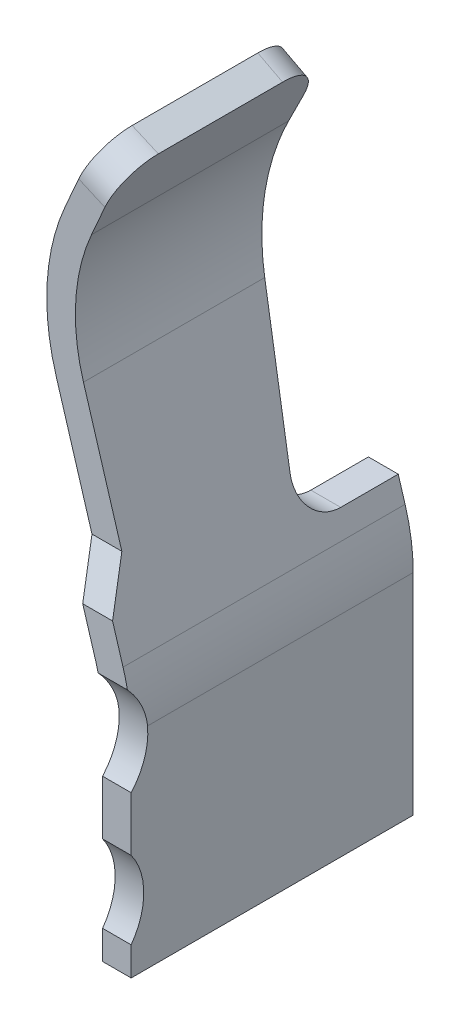
ISO-10303-21;
HEADER;
FILE_DESCRIPTION(('STEP AP214'),'2;1');
FILE_NAME('part.step','',(''),(''),'','','');
FILE_SCHEMA(('AUTOMOTIVE_DESIGN { 1 0 10303 214 1 1 1 1 }'));
ENDSEC;
DATA;
#1=APPLICATION_CONTEXT('core data for automotive mechanical design processes');
#2=APPLICATION_PROTOCOL_DEFINITION('international standard','automotive_design',2000,#1);
#3=PRODUCT_CONTEXT('',#1,'mechanical');
#4=PRODUCT('Part','Part','',(#3));
#5=PRODUCT_RELATED_PRODUCT_CATEGORY('part','',(#4));
#6=PRODUCT_DEFINITION_FORMATION('','',#4);
#7=PRODUCT_DEFINITION_CONTEXT('part definition',#1,'design');
#8=PRODUCT_DEFINITION('design','',#6,#7);
#9=PRODUCT_DEFINITION_SHAPE('','',#8);
#10=(LENGTH_UNIT() NAMED_UNIT(*) SI_UNIT(.MILLI.,.METRE.));
#11=(NAMED_UNIT(*) PLANE_ANGLE_UNIT() SI_UNIT($,.RADIAN.));
#12=(NAMED_UNIT(*) SI_UNIT($,.STERADIAN.) SOLID_ANGLE_UNIT());
#13=UNCERTAINTY_MEASURE_WITH_UNIT(LENGTH_MEASURE(1.E-05),#10,'distance_accuracy_value','');
#14=(GEOMETRIC_REPRESENTATION_CONTEXT(3) GLOBAL_UNCERTAINTY_ASSIGNED_CONTEXT((#13)) GLOBAL_UNIT_ASSIGNED_CONTEXT((#10,
#11,#12)) REPRESENTATION_CONTEXT('',''));
#15=CARTESIAN_POINT('',(0.,0.,0.));
#16=DIRECTION('',(0.,0.,1.));
#17=DIRECTION('',(1.,0.,0.));
#18=AXIS2_PLACEMENT_3D('',#15,#16,#17);
#19=CARTESIAN_POINT('',(4.41844493318108,3.52330708865174,0.423604352914839));
#20=DIRECTION('',(0.915327071470027,-0.402711251685502,0.));
#21=DIRECTION('',(0.402711251685502,0.915327071470027,0.));
#22=AXIS2_PLACEMENT_3D('',#19,#20,#21);
#23=CYLINDRICAL_SURFACE('',#22,0.2);
#24=CARTESIAN_POINT('',(4.41844493318109,3.52330708865174,0.423604352914839));
#25=DIRECTION('',(-0.915327071470027,0.402711251685502,0.));
#26=DIRECTION('',(0.402711251685502,0.915327071470027,0.));
#27=AXIS2_PLACEMENT_3D('',#24,#25,#26);
#28=CIRCLE('',#27,0.2);
#29=CARTESIAN_POINT('',(4.41844493318109,3.52330708865174,0.623604352914839));
#30=VERTEX_POINT('',#29);
#31=CARTESIAN_POINT('',(4.49898718351818,3.70637250294574,0.423604352914839));
#32=VERTEX_POINT('',#31);
#33=EDGE_CURVE('E299',#30,#32,#28,.T.);
#34=ORIENTED_EDGE('',*,*,#33,.F.);
#35=DIRECTION('',(-0.915327071470027,0.402711251685503,0.));
#36=VECTOR('',#35,1.);
#37=CARTESIAN_POINT('',(-20.1915059297134,14.3508073613119,0.623604352914805));
#38=LINE('',#37,#36);
#39=CARTESIAN_POINT('',(4.55574399390159,3.46290040089891,0.623604352914839));
#40=VERTEX_POINT('',#39);
#41=EDGE_CURVE('E27',#40,#30,#38,.T.);
#42=ORIENTED_EDGE('',*,*,#41,.F.);
#43=CARTESIAN_POINT('',(4.55574399390159,3.46290040089891,0.423604352914839));
#44=DIRECTION('',(0.915327071470027,-0.402711251685502,0.));
#45=DIRECTION('',(-0.402711251685502,-0.915327071470027,0.));
#46=AXIS2_PLACEMENT_3D('',#43,#44,#45);
#47=CIRCLE('',#46,0.2);
#48=CARTESIAN_POINT('',(4.63628624423869,3.64596581519291,0.423604352914839));
#49=VERTEX_POINT('',#48);
#50=EDGE_CURVE('E345',#49,#40,#47,.T.);
#51=ORIENTED_EDGE('',*,*,#50,.F.);
#52=DIRECTION('',(0.915327071470027,-0.402711251685503,0.));
#53=VECTOR('',#52,1.);
#54=CARTESIAN_POINT('',(4.49898718351818,3.70637250294574,0.423604352914839));
#55=LINE('',#54,#53);
#56=EDGE_CURVE('E335',#32,#49,#55,.T.);
#57=ORIENTED_EDGE('',*,*,#56,.F.);
#58=EDGE_LOOP('',(#34,#42,#51,#57));
#59=FACE_BOUND('',#58,.T.);
#60=ADVANCED_FACE('F16',(#59),#23,.T.);
#61=CARTESIAN_POINT('',(4.39613725867001,3.53312166947706,-0.236832722369337));
#62=DIRECTION('',(-0.914255270392899,0.402239697454472,-0.0483789866630451));
#63=DIRECTION('',(-0.402711251685501,-0.915327071470027,0.));
#64=AXIS2_PLACEMENT_3D('',#61,#62,#63);
#65=CYLINDRICAL_SURFACE('',#64,0.2);
#66=CARTESIAN_POINT('',(4.54694053804578,3.44289092405021,-0.427421697659668));
#67=CARTESIAN_POINT('',(4.59801746519236,3.55898426375477,-0.441384710680955));
#68=CARTESIAN_POINT('',(4.63628624423869,3.64596581519291,-0.356133634256613));
#69=CARTESIAN_POINT('',(4.63628624423869,3.64596581519291,-0.228386927890316));
#70=(BOUNDED_CURVE() B_SPLINE_CURVE(3,(#66,#67,#68,#69),.UNSPECIFIED.,.F.,
.F.) B_SPLINE_CURVE_WITH_KNOTS((4,4),(6.17366415670651,7.85398163397443),
.UNSPECIFIED.) CURVE() GEOMETRIC_REPRESENTATION_ITEM() RATIONAL_B_SPLINE_CURVE((1.,
0.77822974253387,0.77822974253387,1.)) REPRESENTATION_ITEM(''));
#71=CARTESIAN_POINT('',(4.54694053804578,3.44289092405021,-0.427421697659668));
#72=VERTEX_POINT('',#71);
#73=CARTESIAN_POINT('',(4.63628624423869,3.64596581519291,-0.228386927890316));
#74=VERTEX_POINT('',#73);
#75=EDGE_CURVE('E340',#72,#74,#70,.T.);
#76=ORIENTED_EDGE('',*,*,#75,.F.);
#77=DIRECTION('',(0.914255270392898,-0.402239697454473,0.0483789866630451));
#78=VECTOR('',#77,1.);
#79=CARTESIAN_POINT('',(-20.791852655037,14.5910558161891,-1.76825633941021));
#80=LINE('',#79,#78);
#81=CARTESIAN_POINT('',(4.40964147732527,3.50329761180303,-0.434687053017796));
#82=VERTEX_POINT('',#81);
#83=EDGE_CURVE('E11',#82,#72,#80,.T.);
#84=ORIENTED_EDGE('',*,*,#83,.F.);
#85=CARTESIAN_POINT('',(4.49898718351818,3.70637250294574,-0.235652283248443));
#86=CARTESIAN_POINT('',(4.49898718351819,3.70637250294574,-0.363398989614741));
#87=CARTESIAN_POINT('',(4.46071840447187,3.6193909515076,-0.448650066039083));
#88=CARTESIAN_POINT('',(4.40964147732527,3.50329761180303,-0.434687053017796));
#89=(BOUNDED_CURVE() B_SPLINE_CURVE(3,(#85,#86,#87,#88),.UNSPECIFIED.,.F.,
.F.) B_SPLINE_CURVE_WITH_KNOTS((4,4),(4.71238898038476,6.39270645765268),
.UNSPECIFIED.) CURVE() GEOMETRIC_REPRESENTATION_ITEM() RATIONAL_B_SPLINE_CURVE((1.,
0.77822974253387,0.77822974253387,1.)) REPRESENTATION_ITEM(''));
#90=CARTESIAN_POINT('',(4.49898718351818,3.70637250294574,-0.235652283248443));
#91=VERTEX_POINT('',#90);
#92=EDGE_CURVE('E324',#91,#82,#89,.T.);
#93=ORIENTED_EDGE('',*,*,#92,.F.);
#94=DIRECTION('',(-0.914255270392898,0.402239697454473,-0.0483789866630451));
#95=VECTOR('',#94,1.);
#96=CARTESIAN_POINT('',(4.47667950900712,3.71618708377106,-0.236832722369337));
#97=LINE('',#96,#95);
#98=EDGE_CURVE('E334',#74,#91,#97,.T.);
#99=ORIENTED_EDGE('',*,*,#98,.F.);
#100=EDGE_LOOP('',(#76,#84,#93,#99));
#101=FACE_BOUND('',#100,.T.);
#102=ADVANCED_FACE('F495',(#101),#65,.T.);
#103=CARTESIAN_POINT('',(-25.65,1.65634067151207,-0.212546111318104));
#104=DIRECTION('',(0.,-1.,0.));
#105=DIRECTION('',(0.,0.,-1.));
#106=AXIS2_PLACEMENT_3D('',#103,#104,#105);
#107=PLANE('',#106);
#108=DIRECTION('',(0.,0.,-1.));
#109=VECTOR('',#108,1.);
#110=CARTESIAN_POINT('',(4.57483507894154,1.65634067151207,-0.740000000000018));
#111=LINE('',#110,#109);
#112=CARTESIAN_POINT('',(4.57483507894154,1.65634067151207,-0.438042305987952));
#113=VERTEX_POINT('',#112);
#114=CARTESIAN_POINT('',(4.57483507894154,1.65634067151207,-0.740000000000018));
#115=VERTEX_POINT('',#114);
#116=EDGE_CURVE('E313',#113,#115,#111,.T.);
#117=ORIENTED_EDGE('',*,*,#116,.F.);
#118=DIRECTION('',(1.,0.,0.));
#119=VECTOR('',#118,1.);
#120=CARTESIAN_POINT('',(4.73150340910556,1.65634067151207,-0.438042305987951));
#121=LINE('',#120,#119);
#122=CARTESIAN_POINT('',(4.73150340910558,1.65634067151207,-0.438042305987951));
#123=VERTEX_POINT('',#122);
#124=EDGE_CURVE('E403',#113,#123,#121,.T.);
#125=ORIENTED_EDGE('',*,*,#124,.T.);
#126=DIRECTION('',(0.,0.,1.));
#127=VECTOR('',#126,1.);
#128=CARTESIAN_POINT('',(4.73150340910558,1.65634067151207,-0.740000000000018));
#129=LINE('',#128,#127);
#130=CARTESIAN_POINT('',(4.73150340910558,1.65634067151207,-0.740000000000018));
#131=VERTEX_POINT('',#130);
#132=EDGE_CURVE('E359',#131,#123,#129,.T.);
#133=ORIENTED_EDGE('',*,*,#132,.F.);
#134=DIRECTION('',(-1.,0.,0.));
#135=VECTOR('',#134,1.);
#136=CARTESIAN_POINT('',(3.81,1.65634067151207,-0.740000000000019));
#137=LINE('',#136,#135);
#138=EDGE_CURVE('E275',#131,#115,#137,.T.);
#139=ORIENTED_EDGE('',*,*,#138,.T.);
#140=EDGE_LOOP('',(#117,#125,#133,#139));
#141=FACE_BOUND('',#140,.T.);
#142=ADVANCED_FACE('F595',(#141),#107,.F.);
#143=CARTESIAN_POINT('',(-25.65,3.70637250294571,-0.459111687165995));
#144=DIRECTION('',(0.,0.119413416546905,0.992844618230162));
#145=DIRECTION('',(1.,0.,0.));
#146=AXIS2_PLACEMENT_3D('',#143,#144,#145);
#147=PLANE('',#146);
#148=DIRECTION('',(-0.28674853992682,0.951150986717314,-0.11439875574724));
#149=VECTOR('',#148,1.);
#150=CARTESIAN_POINT('',(4.7496639548885,1.59610175610151,-0.205300934614502));
#151=LINE('',#150,#149);
#152=CARTESIAN_POINT('',(4.66400830743362,1.88022335482146,-0.239473382341919));
#153=VERTEX_POINT('',#152);
#154=CARTESIAN_POINT('',(4.44341373590366,2.61194022573825,-0.327479914176621));
#155=VERTEX_POINT('',#154);
#156=EDGE_CURVE('E229',#153,#155,#151,.T.);
#157=ORIENTED_EDGE('',*,*,#156,.F.);
#158=DIRECTION('',(-1.,0.,0.));
#159=VECTOR('',#158,1.);
#160=CARTESIAN_POINT('',(4.57483507894153,1.88022335482146,-0.23947338234192));
#161=LINE('',#160,#159);
#162=CARTESIAN_POINT('',(4.50733997726959,1.88022335482146,-0.23947338234192));
#163=VERTEX_POINT('',#162);
#164=EDGE_CURVE('E311',#153,#163,#161,.T.);
#165=ORIENTED_EDGE('',*,*,#164,.T.);
#166=DIRECTION('',(0.286748539926818,-0.951150986717315,0.11439875574724));
#167=VECTOR('',#166,1.);
#168=CARTESIAN_POINT('',(4.60587763511194,1.55337185451571,-0.200161637444145));
#169=LINE('',#168,#167);
#170=CARTESIAN_POINT('',(4.29979823954621,2.56864369924933,-0.322272466749579));
#171=VERTEX_POINT('',#170);
#172=EDGE_CURVE('E321',#171,#163,#169,.T.);
#173=ORIENTED_EDGE('',*,*,#172,.F.);
#174=CARTESIAN_POINT('',(4.34822424609608,3.36370167510267,-0.417897288102545));
#175=CARTESIAN_POINT('',(4.23669920509327,3.11021511680704,-0.387409439934768));
#176=CARTESIAN_POINT('',(4.21986260540396,2.83379189253285,-0.354162906673266));
#177=CARTESIAN_POINT('',(4.29979823954621,2.56864369924933,-0.322272466749579));
#178=(BOUNDED_CURVE() B_SPLINE_CURVE(3,(#174,#175,#176,#177),.UNSPECIFIED.,.F.,
.F.) B_SPLINE_CURVE_WITH_KNOTS((4,4),(4.29791199977039,5.00519872138853),
.UNSPECIFIED.) CURVE() GEOMETRIC_REPRESENTATION_ITEM() RATIONAL_B_SPLINE_CURVE((1.,
0.958744787021091,0.958744787021091,1.)) REPRESENTATION_ITEM(''));
#179=CARTESIAN_POINT('',(4.34822424609608,3.36370167510267,-0.417897288102545));
#180=VERTEX_POINT('',#179);
#181=EDGE_CURVE('E294',#180,#171,#178,.T.);
#182=ORIENTED_EDGE('',*,*,#181,.F.);
#183=DIRECTION('',(-0.400292818236851,-0.909830186054405,0.109428936813832));
#184=VECTOR('',#183,1.);
#185=CARTESIAN_POINT('',(4.36233351008822,3.39577078475993,-0.421754368938234));
#186=LINE('',#185,#184);
#187=EDGE_CURVE('E300',#82,#180,#186,.T.);
#188=ORIENTED_EDGE('',*,*,#187,.F.);
#189=ORIENTED_EDGE('',*,*,#83,.T.);
#190=DIRECTION('',(0.400292818236852,0.909830186054405,-0.109428936813832));
#191=VECTOR('',#190,1.);
#192=CARTESIAN_POINT('',(4.49995081965593,3.33608744850051,-0.414576013974332));
#193=LINE('',#192,#191);
#194=CARTESIAN_POINT('',(4.48552330681658,3.30329498734983,-0.410631932744417));
#195=VERTEX_POINT('',#194);
#196=EDGE_CURVE('E339',#195,#72,#193,.T.);
#197=ORIENTED_EDGE('',*,*,#196,.F.);
#198=CARTESIAN_POINT('',(4.44341373590366,2.61194022573825,-0.327479914176621));
#199=CARTESIAN_POINT('',(4.37390448882344,2.84250387207174,-0.355210731501565));
#200=CARTESIAN_POINT('',(4.3885450102924,3.08287189317973,-0.384120760424611));
#201=CARTESIAN_POINT('',(4.48552330681658,3.30329498734983,-0.410631932744417));
#202=(BOUNDED_CURVE() B_SPLINE_CURVE(3,(#198,#199,#200,#201),.UNSPECIFIED.,.F.,
.F.) B_SPLINE_CURVE_WITH_KNOTS((4,4),(1.27798658579106,1.98527330740919),
.UNSPECIFIED.) CURVE() GEOMETRIC_REPRESENTATION_ITEM() RATIONAL_B_SPLINE_CURVE((1.,
0.958744787021091,0.958744787021091,1.)) REPRESENTATION_ITEM(''));
#203=EDGE_CURVE('E256',#155,#195,#202,.T.);
#204=ORIENTED_EDGE('',*,*,#203,.F.);
#205=EDGE_LOOP('',(#157,#165,#173,#182,#188,#189,#197,#204));
#206=FACE_BOUND('',#205,.T.);
#207=ADVANCED_FACE('F592',(#206),#147,.F.);
#208=CARTESIAN_POINT('',(-25.65,1.94413292378283,0.623604352914797));
#209=DIRECTION('',(0.,0.,-1.));
#210=DIRECTION('',(0.,-1.,0.));
#211=AXIS2_PLACEMENT_3D('',#208,#209,#210);
#212=PLANE('',#211);
#213=DIRECTION('',(-0.402711251685501,-0.915327071470028,0.));
#214=VECTOR('',#213,1.);
#215=CARTESIAN_POINT('',(4.48552330681658,3.30329498734984,0.623604352914839));
#216=LINE('',#215,#214);
#217=CARTESIAN_POINT('',(4.48552330681658,3.30329498734984,0.623604352914839));
#218=VERTEX_POINT('',#217);
#219=EDGE_CURVE('E269',#40,#218,#216,.T.);
#220=ORIENTED_EDGE('',*,*,#219,.F.);
#221=ORIENTED_EDGE('',*,*,#41,.T.);
#222=DIRECTION('',(0.4027112516855,0.915327071470028,0.));
#223=VECTOR('',#222,1.);
#224=CARTESIAN_POINT('',(4.34822424609608,3.36370167510267,0.623604352914839));
#225=LINE('',#224,#223);
#226=CARTESIAN_POINT('',(4.34822424609608,3.36370167510267,0.623604352914839));
#227=VERTEX_POINT('',#226);
#228=EDGE_CURVE('E295',#227,#30,#225,.T.);
#229=ORIENTED_EDGE('',*,*,#228,.F.);
#230=CARTESIAN_POINT('',(5.40085037828661,2.90058373566433,0.62360435291484));
#231=DIRECTION('',(0.,0.,-1.));
#232=DIRECTION('',(-1.,0.,0.));
#233=AXIS2_PLACEMENT_3D('',#230,#231,#232);
#234=CIRCLE('',#233,1.15);
#235=CARTESIAN_POINT('',(4.29979823954621,2.56864369924933,0.623604352914839));
#236=VERTEX_POINT('',#235);
#237=EDGE_CURVE('E289',#236,#227,#234,.T.);
#238=ORIENTED_EDGE('',*,*,#237,.F.);
#239=DIRECTION('',(-0.288643509926088,0.957436642382956,0.));
#240=VECTOR('',#239,1.);
#241=CARTESIAN_POINT('',(4.62382114602551,1.49385284836845,0.623604352914839));
#242=LINE('',#241,#240);
#243=CARTESIAN_POINT('',(4.48807282006432,1.94413292378283,0.623604352914839));
#244=VERTEX_POINT('',#243);
#245=EDGE_CURVE('E283',#244,#236,#242,.T.);
#246=ORIENTED_EDGE('',*,*,#245,.F.);
#247=DIRECTION('',(1.,0.,0.));
#248=VECTOR('',#247,1.);
#249=CARTESIAN_POINT('',(-25.65,1.94413292378283,0.623604352914797));
#250=LINE('',#249,#248);
#251=CARTESIAN_POINT('',(4.64474115022836,1.94413292378283,0.623604352914839));
#252=VERTEX_POINT('',#251);
#253=EDGE_CURVE('E242',#244,#252,#250,.T.);
#254=ORIENTED_EDGE('',*,*,#253,.T.);
#255=DIRECTION('',(0.28864350992609,-0.957436642382956,0.));
#256=VECTOR('',#255,1.);
#257=CARTESIAN_POINT('',(4.76743664238296,1.53714937485737,0.623604352914839));
#258=LINE('',#257,#256);
#259=CARTESIAN_POINT('',(4.44341373590366,2.61194022573825,0.623604352914839));
#260=VERTEX_POINT('',#259);
#261=EDGE_CURVE('E236',#260,#252,#258,.T.);
#262=ORIENTED_EDGE('',*,*,#261,.F.);
#263=CARTESIAN_POINT('',(5.40085037828661,2.90058373566433,0.62360435291484));
#264=DIRECTION('',(0.,0.,1.));
#265=DIRECTION('',(-1.,0.,0.));
#266=AXIS2_PLACEMENT_3D('',#263,#264,#265);
#267=CIRCLE('',#266,1.);
#268=EDGE_CURVE('E239',#218,#260,#267,.T.);
#269=ORIENTED_EDGE('',*,*,#268,.F.);
#270=EDGE_LOOP('',(#220,#221,#229,#238,#246,#254,#262,#269));
#271=FACE_BOUND('',#270,.T.);
#272=ADVANCED_FACE('F238',(#271),#212,.F.);
#273=CARTESIAN_POINT('',(-25.65,1.7003498353216,0.749999999999972));
#274=DIRECTION('',(0.,-0.460287319631494,-0.887770005906065));
#275=DIRECTION('',(0.,-0.887770005906065,0.460287319631494));
#276=AXIS2_PLACEMENT_3D('',#273,#274,#275);
#277=PLANE('',#276);
#278=DIRECTION('',(-1.,0.,0.));
#279=VECTOR('',#278,1.);
#280=CARTESIAN_POINT('',(3.81,1.7196371362757,0.739999999999981));
#281=LINE('',#280,#279);
#282=CARTESIAN_POINT('',(4.71242108767926,1.7196371362757,0.739999999999982));
#283=VERTEX_POINT('',#282);
#284=CARTESIAN_POINT('',(4.55575275751522,1.7196371362757,0.739999999999982));
#285=VERTEX_POINT('',#284);
#286=EDGE_CURVE('E352',#283,#285,#281,.T.);
#287=ORIENTED_EDGE('',*,*,#286,.F.);
#288=DIRECTION('',(0.258541028225372,-0.857586072334425,0.444637678635293));
#289=VECTOR('',#288,1.);
#290=CARTESIAN_POINT('',(4.58642343830643,2.13757401070795,0.523309818502748));
#291=LINE('',#290,#289);
#292=EDGE_CURVE('E245',#252,#283,#291,.T.);
#293=ORIENTED_EDGE('',*,*,#292,.F.);
#294=ORIENTED_EDGE('',*,*,#253,.F.);
#295=DIRECTION('',(-0.258541028225371,0.857586072334425,-0.444637678635293));
#296=VECTOR('',#295,1.);
#297=CARTESIAN_POINT('',(4.4402273619162,2.10283732290249,0.541319952677684));
#298=LINE('',#297,#296);
#299=EDGE_CURVE('E288',#285,#244,#298,.T.);
#300=ORIENTED_EDGE('',*,*,#299,.F.);
#301=EDGE_LOOP('',(#287,#293,#294,#300));
#302=FACE_BOUND('',#301,.T.);
#303=ADVANCED_FACE('F587',(#302),#277,.F.);
#304=CARTESIAN_POINT('',(3.81,1.24850586493128,0.739999999999981));
#305=DIRECTION('',(0.,0.,-1.));
#306=DIRECTION('',(0.,-1.,0.));
#307=AXIS2_PLACEMENT_3D('',#304,#305,#306);
#308=PLANE('',#307);
#309=DIRECTION('',(0.,-1.,0.));
#310=VECTOR('',#309,1.);
#311=CARTESIAN_POINT('',(4.81,0.145965815192914,0.739999999999982));
#312=LINE('',#311,#310);
#313=CARTESIAN_POINT('',(4.81,0.296740599868486,0.739999999999982));
#314=VERTEX_POINT('',#313);
#315=CARTESIAN_POINT('',(4.81,0.145965815192914,0.739999999999982));
#316=VERTEX_POINT('',#315);
#317=EDGE_CURVE('E304',#314,#316,#312,.T.);
#318=ORIENTED_EDGE('',*,*,#317,.F.);
#319=DIRECTION('',(-1.,0.,0.));
#320=VECTOR('',#319,1.);
#321=CARTESIAN_POINT('',(-25.65,0.296740599868486,0.73999999999994));
#322=LINE('',#321,#320);
#323=CARTESIAN_POINT('',(4.66,0.296740599868486,0.739999999999982));
#324=VERTEX_POINT('',#323);
#325=EDGE_CURVE('E277',#314,#324,#322,.T.);
#326=ORIENTED_EDGE('',*,*,#325,.T.);
#327=DIRECTION('',(0.,1.,0.));
#328=VECTOR('',#327,1.);
#329=CARTESIAN_POINT('',(4.66,0.145965815192914,0.739999999999982));
#330=LINE('',#329,#328);
#331=CARTESIAN_POINT('',(4.66,0.145965815192914,0.739999999999982));
#332=VERTEX_POINT('',#331);
#333=EDGE_CURVE('E445',#332,#324,#330,.T.);
#334=ORIENTED_EDGE('',*,*,#333,.F.);
#335=DIRECTION('',(-1.,0.,0.));
#336=VECTOR('',#335,1.);
#337=CARTESIAN_POINT('',(4.66,0.145965815192914,0.739999999999982));
#338=LINE('',#337,#336);
#339=EDGE_CURVE('E655',#316,#332,#338,.T.);
#340=ORIENTED_EDGE('',*,*,#339,.F.);
#341=EDGE_LOOP('',(#318,#326,#334,#340));
#342=FACE_BOUND('',#341,.T.);
#343=ADVANCED_FACE('F584',(#342),#308,.F.);
#344=CARTESIAN_POINT('',(3.81,1.24850586493128,-0.740000000000019));
#345=DIRECTION('',(0.,0.,-1.));
#346=DIRECTION('',(0.,-1.,0.));
#347=AXIS2_PLACEMENT_3D('',#344,#345,#346);
#348=PLANE('',#347);
#349=ORIENTED_EDGE('',*,*,#138,.F.);
#350=DIRECTION('',(0.28864350992609,-0.957436642382956,0.));
#351=VECTOR('',#350,1.);
#352=CARTESIAN_POINT('',(4.76743664238296,1.53714937485737,-0.740000000000018));
#353=LINE('',#352,#351);
#354=CARTESIAN_POINT('',(4.76743664238296,1.53714937485737,-0.740000000000018));
#355=VERTEX_POINT('',#354);
#356=EDGE_CURVE('E255',#131,#355,#353,.T.);
#357=ORIENTED_EDGE('',*,*,#356,.T.);
#358=CARTESIAN_POINT('',(3.81,1.24850586493128,-0.740000000000019));
#359=DIRECTION('',(0.,0.,-1.));
#360=DIRECTION('',(-1.,0.,0.));
#361=AXIS2_PLACEMENT_3D('',#358,#359,#360);
#362=CIRCLE('',#361,1.);
#363=CARTESIAN_POINT('',(4.81,1.24850586493128,-0.740000000000018));
#364=VERTEX_POINT('',#363);
#365=EDGE_CURVE('E301',#355,#364,#362,.T.);
#366=ORIENTED_EDGE('',*,*,#365,.T.);
#367=DIRECTION('',(0.,-1.,0.));
#368=VECTOR('',#367,1.);
#369=CARTESIAN_POINT('',(4.81,0.145965815192914,-0.740000000000018));
#370=LINE('',#369,#368);
#371=CARTESIAN_POINT('',(4.81,0.145965815192914,-0.740000000000018));
#372=VERTEX_POINT('',#371);
#373=EDGE_CURVE('E42',#364,#372,#370,.T.);
#374=ORIENTED_EDGE('',*,*,#373,.T.);
#375=DIRECTION('',(-1.,0.,0.));
#376=VECTOR('',#375,1.);
#377=CARTESIAN_POINT('',(4.66,0.145965815192914,-0.740000000000018));
#378=LINE('',#377,#376);
#379=CARTESIAN_POINT('',(4.66,0.145965815192914,-0.740000000000018));
#380=VERTEX_POINT('',#379);
#381=EDGE_CURVE('E375',#372,#380,#378,.T.);
#382=ORIENTED_EDGE('',*,*,#381,.T.);
#383=DIRECTION('',(0.,1.,0.));
#384=VECTOR('',#383,1.);
#385=CARTESIAN_POINT('',(4.66,0.145965815192914,-0.740000000000018));
#386=LINE('',#385,#384);
#387=CARTESIAN_POINT('',(4.66,1.24850586493128,-0.740000000000018));
#388=VERTEX_POINT('',#387);
#389=EDGE_CURVE('E456',#380,#388,#386,.T.);
#390=ORIENTED_EDGE('',*,*,#389,.T.);
#391=CARTESIAN_POINT('',(3.81,1.24850586493128,-0.740000000000019));
#392=DIRECTION('',(0.,0.,1.));
#393=DIRECTION('',(-1.,0.,0.));
#394=AXIS2_PLACEMENT_3D('',#391,#392,#393);
#395=CIRCLE('',#394,0.85);
#396=CARTESIAN_POINT('',(4.62382114602551,1.49385284836845,-0.740000000000018));
#397=VERTEX_POINT('',#396);
#398=EDGE_CURVE('E381',#388,#397,#395,.T.);
#399=ORIENTED_EDGE('',*,*,#398,.T.);
#400=DIRECTION('',(-0.288643509926088,0.957436642382956,0.));
#401=VECTOR('',#400,1.);
#402=CARTESIAN_POINT('',(4.62382114602551,1.49385284836845,-0.740000000000018));
#403=LINE('',#402,#401);
#404=EDGE_CURVE('E320',#397,#115,#403,.T.);
#405=ORIENTED_EDGE('',*,*,#404,.T.);
#406=EDGE_LOOP('',(#349,#357,#366,#374,#382,#390,#399,#405));
#407=FACE_BOUND('',#406,.T.);
#408=ADVANCED_FACE('F583',(#407),#348,.T.);
#409=CARTESIAN_POINT('',(4.81,0.145965815192914,-0.740000000000018));
#410=DIRECTION('',(-1.,0.,0.));
#411=DIRECTION('',(0.,0.,1.));
#412=AXIS2_PLACEMENT_3D('',#409,#410,#411);
#413=PLANE('',#412);
#414=DIRECTION('',(0.,0.,1.));
#415=VECTOR('',#414,1.);
#416=CARTESIAN_POINT('',(4.81,1.24850586493128,-0.740000000000018));
#417=LINE('',#416,#415);
#418=CARTESIAN_POINT('',(4.81,1.24850586493128,0.654029100989327));
#419=VERTEX_POINT('',#418);
#420=EDGE_CURVE('E305',#364,#419,#417,.T.);
#421=ORIENTED_EDGE('',*,*,#420,.T.);
#422=CARTESIAN_POINT('',(4.81,1.21669179396546,0.995153761033099));
#423=DIRECTION('',(1.,0.,0.));
#424=DIRECTION('',(0.,0.,1.));
#425=AXIS2_PLACEMENT_3D('',#422,#423,#424);
#426=CIRCLE('',#425,0.342604974863759);
#427=CARTESIAN_POINT('',(4.81,0.988055123608201,0.739999999999982));
#428=VERTEX_POINT('',#427);
#429=EDGE_CURVE('E370',#428,#419,#426,.T.);
#430=ORIENTED_EDGE('',*,*,#429,.F.);
#431=DIRECTION('',(0.,-1.,0.));
#432=VECTOR('',#431,1.);
#433=CARTESIAN_POINT('',(4.81,0.145965815192914,0.739999999999982));
#434=LINE('',#433,#432);
#435=CARTESIAN_POINT('',(4.81,0.703259400131467,0.739999999999982));
#436=VERTEX_POINT('',#435);
#437=EDGE_CURVE('E361',#428,#436,#434,.T.);
#438=ORIENTED_EDGE('',*,*,#437,.T.);
#439=CARTESIAN_POINT('',(4.81,0.499999999999977,1.01942683457021));
#440=DIRECTION('',(1.,0.,0.));
#441=DIRECTION('',(0.,0.,1.));
#442=AXIS2_PLACEMENT_3D('',#439,#440,#441);
#443=CIRCLE('',#442,0.345533991988848);
#444=EDGE_CURVE('E281',#314,#436,#443,.T.);
#445=ORIENTED_EDGE('',*,*,#444,.F.);
#446=ORIENTED_EDGE('',*,*,#317,.T.);
#447=DIRECTION('',(0.,0.,1.));
#448=VECTOR('',#447,1.);
#449=CARTESIAN_POINT('',(4.81,0.145965815192914,-0.740000000000018));
#450=LINE('',#449,#448);
#451=EDGE_CURVE('E379',#372,#316,#450,.T.);
#452=ORIENTED_EDGE('',*,*,#451,.F.);
#453=ORIENTED_EDGE('',*,*,#373,.F.);
#454=EDGE_LOOP('',(#421,#430,#438,#445,#446,#452,#453));
#455=FACE_BOUND('',#454,.T.);
#456=ADVANCED_FACE('F574',(#455),#413,.F.);
#457=CARTESIAN_POINT('',(3.81,1.24850586493128,-0.740000000000019));
#458=DIRECTION('',(0.,0.,1.));
#459=DIRECTION('',(1.,0.,0.));
#460=AXIS2_PLACEMENT_3D('',#457,#458,#459);
#461=CYLINDRICAL_SURFACE('',#460,1.);
#462=CARTESIAN_POINT('',(3.81,1.24850586493128,0.739999999999981));
#463=DIRECTION('',(0.,0.,-1.));
#464=DIRECTION('',(-1.,0.,0.));
#465=AXIS2_PLACEMENT_3D('',#462,#463,#464);
#466=CIRCLE('',#465,1.);
#467=CARTESIAN_POINT('',(4.76743664238295,1.53714937485737,0.739999999999982));
#468=VERTEX_POINT('',#467);
#469=CARTESIAN_POINT('',(4.79043911813473,1.44532846432271,0.739999999999982));
#470=VERTEX_POINT('',#469);
#471=EDGE_CURVE('E365',#468,#470,#466,.T.);
#472=ORIENTED_EDGE('',*,*,#471,.T.);
#473=CARTESIAN_POINT('',(4.79043911813472,1.44532846432271,0.739999999999982));
#474=CARTESIAN_POINT('',(4.79112131741684,1.44193024717417,0.736954698545497));
#475=CARTESIAN_POINT('',(4.79179721850851,1.43847176034264,0.733975045899673));
#476=CARTESIAN_POINT('',(4.793128559526,1.43145643098159,0.728168909339876));
#477=CARTESIAN_POINT('',(4.79378408931625,1.42790021102154,0.725341693611786));
#478=CARTESIAN_POINT('',(4.79507168816975,1.42068928784943,0.719840380711082));
#479=CARTESIAN_POINT('',(4.79570383827925,1.41703501951577,0.71716573280542));
#480=CARTESIAN_POINT('',(4.7969415721266,1.40962817005605,0.711969336935208));
#481=CARTESIAN_POINT('',(4.79754721552131,1.40587584366106,0.709447240161664));
#482=CARTESIAN_POINT('',(4.79872877129688,1.39827302810691,0.704555749407203));
#483=CARTESIAN_POINT('',(4.79930470888849,1.3944226264712,0.702186225501798));
#484=CARTESIAN_POINT('',(4.800423617226,1.38662388081493,0.697599649617223));
#485=CARTESIAN_POINT('',(4.8009665658168,1.38267547342748,0.695382699975703));
#486=CARTESIAN_POINT('',(4.80201619604996,1.37468096295891,0.691101059928101));
#487=CARTESIAN_POINT('',(4.80252279573887,1.37063466501766,0.689036713287234));
#488=CARTESIAN_POINT('',(4.80349635159398,1.36244473872734,0.685059955148872));
#489=CARTESIAN_POINT('',(4.80396315439605,1.35830080604148,0.683148133100298));
#490=CARTESIAN_POINT('',(4.80485385101726,1.34991442649087,0.679475891500459));
#491=CARTESIAN_POINT('',(4.80527749507101,1.34567156354324,0.677716361222166));
#492=CARTESIAN_POINT('',(4.80607352805793,1.33713872195216,0.674376033868776));
#493=CARTESIAN_POINT('',(4.80644618935103,1.33284913740271,0.672794295796527));
#494=CARTESIAN_POINT('',(4.80713863854792,1.32422362544486,0.669809238507249));
#495=CARTESIAN_POINT('',(4.80745863414995,1.31988795555424,0.668405223722618));
#496=CARTESIAN_POINT('',(4.80804414411012,1.3111710125325,0.665775382478355));
#497=CARTESIAN_POINT('',(4.80830979142469,1.30678987892384,0.664549123358638));
#498=CARTESIAN_POINT('',(4.80878499367846,1.29798278695399,0.662274523841769));
#499=CARTESIAN_POINT('',(4.80899459796072,1.29355687160846,0.661226027233375));
#500=CARTESIAN_POINT('',(4.80935611224076,1.28466100981375,0.659306657193404));
#501=CARTESIAN_POINT('',(4.80950798054882,1.28019103392983,0.65843591232121));
#502=CARTESIAN_POINT('',(4.80975239151872,1.27120787033427,0.656871822149784));
#503=CARTESIAN_POINT('',(4.80984479570128,1.26669460642052,0.65617889318396));
#504=CARTESIAN_POINT('',(4.80996875637607,1.25762568522579,0.654969909316688));
#505=CARTESIAN_POINT('',(4.81000007412201,1.25306993125335,0.654454554866671));
#506=CARTESIAN_POINT('',(4.81,1.24850586493128,0.654029100989326));
#507=B_SPLINE_CURVE_WITH_KNOTS('',3,(#473,#474,#475,#476,#477,#478,#479,#480,#481,#482,#483,
#484,#485,#486,#487,#488,#489,#490,#491,#492,#493,#494,#495,#496,#497,#498,#499,#500,#501,#502,
#503,#504,#505,#506),.UNSPECIFIED.,.F.,.F.,(4,2,2,2,2,2,2,2,2,2,2,2,2,2,2,2,4),(0.,
0.013840721206231,0.0276076629971235,0.0413212735161823,0.0550022400254227,0.0686713979831094,
0.0823496367920793,0.0960578043229842,0.109816612381107,0.123650992269108,0.137408310969834,
0.151110002599701,0.164777762982982,0.178433449670465,0.192098978145581,0.205796216649571,
0.219546882133365),.UNSPECIFIED.);
#508=EDGE_CURVE('E533',#470,#419,#507,.T.);
#509=ORIENTED_EDGE('',*,*,#508,.T.);
#510=ORIENTED_EDGE('',*,*,#420,.F.);
#511=ORIENTED_EDGE('',*,*,#365,.F.);
#512=DIRECTION('',(0.,0.,1.));
#513=VECTOR('',#512,1.);
#514=CARTESIAN_POINT('',(4.76743664238296,1.53714937485737,-0.740000000000018));
#515=LINE('',#514,#513);
#516=EDGE_CURVE('E329',#355,#468,#515,.T.);
#517=ORIENTED_EDGE('',*,*,#516,.T.);
#518=EDGE_LOOP('',(#472,#509,#510,#511,#517));
#519=FACE_BOUND('',#518,.T.);
#520=ADVANCED_FACE('F498',(#519),#461,.T.);
#521=CARTESIAN_POINT('',(4.76743664238296,1.53714937485737,-0.740000000000018));
#522=DIRECTION('',(-0.957436642382956,-0.28864350992609,0.));
#523=DIRECTION('',(-0.28864350992609,0.957436642382956,0.));
#524=AXIS2_PLACEMENT_3D('',#521,#522,#523);
#525=PLANE('',#524);
#526=ORIENTED_EDGE('',*,*,#356,.F.);
#527=ORIENTED_EDGE('',*,*,#132,.T.);
#528=CARTESIAN_POINT('',(4.73150340910558,1.65634067151207,-0.438042305987951));
#529=CARTESIAN_POINT('',(4.73150340910558,1.65634067151208,-0.320885018462571));
#530=CARTESIAN_POINT('',(4.70652837656352,1.73918338398669,-0.238042305987951));
#531=CARTESIAN_POINT('',(4.67120834682184,1.85634067151208,-0.238042305987952));
#532=(BOUNDED_CURVE() B_SPLINE_CURVE(3,(#528,#529,#530,#531),.UNSPECIFIED.,.F.,
.F.) B_SPLINE_CURVE_WITH_KNOTS((4,4),(3.1415926535898,4.71238898038469),
.UNSPECIFIED.) CURVE() GEOMETRIC_REPRESENTATION_ITEM() RATIONAL_B_SPLINE_CURVE((1.,
0.804737854124365,0.804737854124365,1.)) REPRESENTATION_ITEM(''));
#533=CARTESIAN_POINT('',(4.67120834682184,1.85634067151208,-0.238042305987952));
#534=VERTEX_POINT('',#533);
#535=EDGE_CURVE('E420',#123,#534,#532,.T.);
#536=ORIENTED_EDGE('',*,*,#535,.T.);
#537=CARTESIAN_POINT('',(4.67120834682184,1.85634067151208,-0.238042305987952));
#538=CARTESIAN_POINT('',(4.66880115558451,1.86432537588468,-0.238042305987952));
#539=CARTESIAN_POINT('',(4.66639827429865,1.87229578405696,-0.23851990151267));
#540=CARTESIAN_POINT('',(4.66400830743362,1.88022335482146,-0.239473382341919));
#541=(BOUNDED_CURVE() B_SPLINE_CURVE(3,(#537,#538,#539,#540),.UNSPECIFIED.,.F.,
.F.) B_SPLINE_CURVE_WITH_KNOTS((4,4),(4.71238898038469,4.83208803082147),
.UNSPECIFIED.) CURVE() GEOMETRIC_REPRESENTATION_ITEM() RATIONAL_B_SPLINE_CURVE((1.,
0.998806367803328,0.998806367803328,1.)) REPRESENTATION_ITEM(''));
#542=EDGE_CURVE('E621',#534,#153,#541,.T.);
#543=ORIENTED_EDGE('',*,*,#542,.T.);
#544=ORIENTED_EDGE('',*,*,#156,.T.);
#545=DIRECTION('',(0.,0.,1.));
#546=VECTOR('',#545,1.);
#547=CARTESIAN_POINT('',(4.44341373590366,2.61194022573825,-0.740000000000018));
#548=LINE('',#547,#546);
#549=EDGE_CURVE('E250',#155,#260,#548,.T.);
#550=ORIENTED_EDGE('',*,*,#549,.T.);
#551=ORIENTED_EDGE('',*,*,#261,.T.);
#552=ORIENTED_EDGE('',*,*,#292,.T.);
#553=DIRECTION('',(0.28864350992609,-0.957436642382956,0.));
#554=VECTOR('',#553,1.);
#555=CARTESIAN_POINT('',(4.76743664238296,1.53714937485737,0.739999999999982));
#556=LINE('',#555,#554);
#557=EDGE_CURVE('E356',#283,#468,#556,.T.);
#558=ORIENTED_EDGE('',*,*,#557,.T.);
#559=ORIENTED_EDGE('',*,*,#516,.F.);
#560=EDGE_LOOP('',(#526,#527,#536,#543,#544,#550,#551,#552,#558,#559));
#561=FACE_BOUND('',#560,.T.);
#562=ADVANCED_FACE('F259',(#561),#525,.F.);
#563=CARTESIAN_POINT('',(5.40085037828662,2.90058373566433,-0.740000000000017));
#564=DIRECTION('',(0.,0.,1.));
#565=DIRECTION('',(1.,0.,0.));
#566=AXIS2_PLACEMENT_3D('',#563,#564,#565);
#567=CYLINDRICAL_SURFACE('',#566,1.);
#568=ORIENTED_EDGE('',*,*,#549,.F.);
#569=ORIENTED_EDGE('',*,*,#203,.T.);
#570=DIRECTION('',(0.,0.,1.));
#571=VECTOR('',#570,1.);
#572=CARTESIAN_POINT('',(4.48552330681658,3.30329498734983,-0.740000000000018));
#573=LINE('',#572,#571);
#574=EDGE_CURVE('E252',#195,#218,#573,.T.);
#575=ORIENTED_EDGE('',*,*,#574,.T.);
#576=ORIENTED_EDGE('',*,*,#268,.T.);
#577=EDGE_LOOP('',(#568,#569,#575,#576));
#578=FACE_BOUND('',#577,.T.);
#579=ADVANCED_FACE('F249',(#578),#567,.F.);
#580=CARTESIAN_POINT('',(4.48552330681658,3.30329498734984,-0.740000000000018));
#581=DIRECTION('',(-0.915327071470028,0.402711251685501,0.));
#582=DIRECTION('',(0.,0.,1.));
#583=AXIS2_PLACEMENT_3D('',#580,#581,#582);
#584=PLANE('',#583);
#585=ORIENTED_EDGE('',*,*,#196,.T.);
#586=ORIENTED_EDGE('',*,*,#75,.T.);
#587=DIRECTION('',(0.,0.,1.));
#588=VECTOR('',#587,1.);
#589=CARTESIAN_POINT('',(4.63628624423869,3.64596581519291,-0.740000000000018));
#590=LINE('',#589,#588);
#591=EDGE_CURVE('E330',#74,#49,#590,.T.);
#592=ORIENTED_EDGE('',*,*,#591,.T.);
#593=ORIENTED_EDGE('',*,*,#50,.T.);
#594=ORIENTED_EDGE('',*,*,#219,.T.);
#595=ORIENTED_EDGE('',*,*,#574,.F.);
#596=EDGE_LOOP('',(#585,#586,#592,#593,#594,#595));
#597=FACE_BOUND('',#596,.T.);
#598=ADVANCED_FACE('F614',(#597),#584,.F.);
#599=CARTESIAN_POINT('',(4.49898718351818,3.70637250294574,-0.740000000000018));
#600=DIRECTION('',(-0.402711251685503,-0.915327071470027,0.));
#601=DIRECTION('',(-0.915327071470027,0.402711251685503,0.));
#602=AXIS2_PLACEMENT_3D('',#599,#600,#601);
#603=PLANE('',#602);
#604=ORIENTED_EDGE('',*,*,#591,.F.);
#605=ORIENTED_EDGE('',*,*,#98,.T.);
#606=DIRECTION('',(0.,0.,1.));
#607=VECTOR('',#606,1.);
#608=CARTESIAN_POINT('',(4.49898718351818,3.70637250294574,-0.740000000000018));
#609=LINE('',#608,#607);
#610=EDGE_CURVE('E293',#91,#32,#609,.T.);
#611=ORIENTED_EDGE('',*,*,#610,.T.);
#612=ORIENTED_EDGE('',*,*,#56,.T.);
#613=EDGE_LOOP('',(#604,#605,#611,#612));
#614=FACE_BOUND('',#613,.T.);
#615=ADVANCED_FACE('F491',(#614),#603,.F.);
#616=CARTESIAN_POINT('',(4.34822424609608,3.36370167510267,-0.740000000000018));
#617=DIRECTION('',(0.915327071470028,-0.4027112516855,0.));
#618=DIRECTION('',(0.,0.,-1.));
#619=AXIS2_PLACEMENT_3D('',#616,#617,#618);
#620=PLANE('',#619);
#621=ORIENTED_EDGE('',*,*,#610,.F.);
#622=ORIENTED_EDGE('',*,*,#92,.T.);
#623=ORIENTED_EDGE('',*,*,#187,.T.);
#624=DIRECTION('',(0.,0.,1.));
#625=VECTOR('',#624,1.);
#626=CARTESIAN_POINT('',(4.34822424609608,3.36370167510267,-0.740000000000018));
#627=LINE('',#626,#625);
#628=EDGE_CURVE('E390',#180,#227,#627,.T.);
#629=ORIENTED_EDGE('',*,*,#628,.T.);
#630=ORIENTED_EDGE('',*,*,#228,.T.);
#631=ORIENTED_EDGE('',*,*,#33,.T.);
#632=EDGE_LOOP('',(#621,#622,#623,#629,#630,#631));
#633=FACE_BOUND('',#632,.T.);
#634=ADVANCED_FACE('F487',(#633),#620,.F.);
#635=CARTESIAN_POINT('',(5.40085037828662,2.90058373566433,-0.740000000000017));
#636=DIRECTION('',(0.,0.,1.));
#637=DIRECTION('',(1.,0.,0.));
#638=AXIS2_PLACEMENT_3D('',#635,#636,#637);
#639=CYLINDRICAL_SURFACE('',#638,1.15);
#640=ORIENTED_EDGE('',*,*,#628,.F.);
#641=ORIENTED_EDGE('',*,*,#181,.T.);
#642=DIRECTION('',(0.,0.,1.));
#643=VECTOR('',#642,1.);
#644=CARTESIAN_POINT('',(4.29979823954621,2.56864369924933,-0.740000000000019));
#645=LINE('',#644,#643);
#646=EDGE_CURVE('E287',#171,#236,#645,.T.);
#647=ORIENTED_EDGE('',*,*,#646,.T.);
#648=ORIENTED_EDGE('',*,*,#237,.T.);
#649=EDGE_LOOP('',(#640,#641,#647,#648));
#650=FACE_BOUND('',#649,.T.);
#651=ADVANCED_FACE('F490',(#650),#639,.T.);
#652=CARTESIAN_POINT('',(4.62382114602551,1.49385284836845,-0.740000000000018));
#653=DIRECTION('',(0.957436642382956,0.288643509926088,0.));
#654=DIRECTION('',(0.,0.,-1.));
#655=AXIS2_PLACEMENT_3D('',#652,#653,#654);
#656=PLANE('',#655);
#657=ORIENTED_EDGE('',*,*,#172,.T.);
#658=CARTESIAN_POINT('',(4.50733997726959,1.88022335482146,-0.23947338234192));
#659=CARTESIAN_POINT('',(4.5097299441346,1.87229578405696,-0.23851990151267));
#660=CARTESIAN_POINT('',(4.51213282542048,1.86432537588468,-0.238042305987952));
#661=CARTESIAN_POINT('',(4.5145400166578,1.85634067151208,-0.238042305987952));
#662=(BOUNDED_CURVE() B_SPLINE_CURVE(3,(#658,#659,#660,#661),.UNSPECIFIED.,.F.,
.F.) B_SPLINE_CURVE_WITH_KNOTS((4,4),(1.45109727635811,1.5707963267949),
.UNSPECIFIED.) CURVE() GEOMETRIC_REPRESENTATION_ITEM() RATIONAL_B_SPLINE_CURVE((1.,
0.998806367803328,0.998806367803328,1.)) REPRESENTATION_ITEM(''));
#663=CARTESIAN_POINT('',(4.5145400166578,1.85634067151208,-0.238042305987952));
#664=VERTEX_POINT('',#663);
#665=EDGE_CURVE('E306',#163,#664,#662,.T.);
#666=ORIENTED_EDGE('',*,*,#665,.T.);
#667=CARTESIAN_POINT('',(4.5145400166578,1.85634067151208,-0.238042305987952));
#668=CARTESIAN_POINT('',(4.54986004639948,1.73918338398669,-0.238042305987952));
#669=CARTESIAN_POINT('',(4.57483507894154,1.65634067151208,-0.320885018462571));
#670=CARTESIAN_POINT('',(4.57483507894154,1.65634067151207,-0.438042305987952));
#671=(BOUNDED_CURVE() B_SPLINE_CURVE(3,(#667,#668,#669,#670),.UNSPECIFIED.,.F.,
.F.) B_SPLINE_CURVE_WITH_KNOTS((4,4),(1.5707963267949,3.1415926535898),
.UNSPECIFIED.) CURVE() GEOMETRIC_REPRESENTATION_ITEM() RATIONAL_B_SPLINE_CURVE((1.,
0.804737854124365,0.804737854124365,1.)) REPRESENTATION_ITEM(''));
#672=EDGE_CURVE('E312',#664,#113,#671,.T.);
#673=ORIENTED_EDGE('',*,*,#672,.T.);
#674=ORIENTED_EDGE('',*,*,#116,.T.);
#675=ORIENTED_EDGE('',*,*,#404,.F.);
#676=DIRECTION('',(0.,0.,1.));
#677=VECTOR('',#676,1.);
#678=CARTESIAN_POINT('',(4.62382114602551,1.49385284836845,-0.740000000000018));
#679=LINE('',#678,#677);
#680=CARTESIAN_POINT('',(4.62382114602551,1.49385284836845,0.739999999999982));
#681=VERTEX_POINT('',#680);
#682=EDGE_CURVE('E385',#397,#681,#679,.T.);
#683=ORIENTED_EDGE('',*,*,#682,.T.);
#684=DIRECTION('',(-0.288643509926088,0.957436642382956,0.));
#685=VECTOR('',#684,1.);
#686=CARTESIAN_POINT('',(4.62382114602551,1.49385284836845,0.739999999999982));
#687=LINE('',#686,#685);
#688=EDGE_CURVE('E273',#681,#285,#687,.T.);
#689=ORIENTED_EDGE('',*,*,#688,.T.);
#690=ORIENTED_EDGE('',*,*,#299,.T.);
#691=ORIENTED_EDGE('',*,*,#245,.T.);
#692=ORIENTED_EDGE('',*,*,#646,.F.);
#693=EDGE_LOOP('',(#657,#666,#673,#674,#675,#683,#689,#690,#691,#692));
#694=FACE_BOUND('',#693,.T.);
#695=ADVANCED_FACE('F480',(#694),#656,.F.);
#696=CARTESIAN_POINT('',(3.81,1.24850586493128,-0.740000000000019));
#697=DIRECTION('',(0.,0.,1.));
#698=DIRECTION('',(1.,0.,0.));
#699=AXIS2_PLACEMENT_3D('',#696,#697,#698);
#700=CYLINDRICAL_SURFACE('',#699,0.85);
#701=DIRECTION('',(0.,0.,1.));
#702=VECTOR('',#701,1.);
#703=CARTESIAN_POINT('',(4.66,1.24850586493128,-0.740000000000018));
#704=LINE('',#703,#702);
#705=CARTESIAN_POINT('',(4.66,1.24850586493128,0.654029100989327));
#706=VERTEX_POINT('',#705);
#707=EDGE_CURVE('E455',#388,#706,#704,.T.);
#708=ORIENTED_EDGE('',*,*,#707,.T.);
#709=CARTESIAN_POINT('',(4.66,1.24850586493128,0.654029100989326));
#710=CARTESIAN_POINT('',(4.66000008790192,1.25307172693067,0.654454720262649));
#711=CARTESIAN_POINT('',(4.65996321394179,1.25762924392979,0.654970441218028));
#712=CARTESIAN_POINT('',(4.65981723689208,1.26670316475255,0.656180580970959));
#713=CARTESIAN_POINT('',(4.65970838571633,1.27121965647091,0.656874371378042));
#714=CARTESIAN_POINT('',(4.65942040339789,1.28021043459179,0.658440607166896));
#715=CARTESIAN_POINT('',(4.65924140666662,1.28468478505201,0.659312709351935));
#716=CARTESIAN_POINT('',(4.65881520972135,1.29359026706935,0.661235215653678));
#717=CARTESIAN_POINT('',(4.65856803077563,1.29802141165828,0.66228556413024));
#718=CARTESIAN_POINT('',(4.65800750291946,1.3068395578978,0.664564290110304));
#719=CARTESIAN_POINT('',(4.65769406910967,1.31122649527135,0.665792895393359));
#720=CARTESIAN_POINT('',(4.65700306354457,1.31995538303798,0.668427852265579));
#721=CARTESIAN_POINT('',(4.65662530965206,1.3242971674594,0.669834705627379));
#722=CARTESIAN_POINT('',(4.65580767637724,1.33293499859295,0.672825870710028));
#723=CARTESIAN_POINT('',(4.65536752821895,1.33723075608409,0.674410943694401));
#724=CARTESIAN_POINT('',(4.65442711043071,1.34577581205583,0.677758358644035));
#725=CARTESIAN_POINT('',(4.65392649735798,1.35002467970643,0.679521703002878));
#726=CARTESIAN_POINT('',(4.65287530667302,1.3584100270012,0.683196490683952));
#727=CARTESIAN_POINT('',(4.65232516662162,1.36254713822215,0.685106618702924));
#728=CARTESIAN_POINT('',(4.65117755921637,1.37072413591787,0.689079813923213));
#729=CARTESIAN_POINT('',(4.65058024734154,1.37476428891431,0.691142377362175));
#730=CARTESIAN_POINT('',(4.64934234117287,1.38274714659961,0.695420264462087));
#731=CARTESIAN_POINT('',(4.64870182190564,1.3866900047576,0.697635323456153));
#732=CARTESIAN_POINT('',(4.64738143447406,1.39447822720198,0.702217943436157));
#733=CARTESIAN_POINT('',(4.64670157427935,1.39832361100923,0.704585473545538));
#734=CARTESIAN_POINT('',(4.64530633778053,1.40591692940919,0.709472808735753));
#735=CARTESIAN_POINT('',(4.64459091665295,1.40966473145107,0.7119928069134));
#736=CARTESIAN_POINT('',(4.64312828109076,1.41706305442155,0.71718484719857));
#737=CARTESIAN_POINT('',(4.64238098377839,1.42071327585316,0.719857292618993));
#738=CARTESIAN_POINT('',(4.64085822273564,1.42791663066826,0.725354048734527));
#739=CARTESIAN_POINT('',(4.64008265290595,1.43146928614062,0.728178955935433));
#740=CARTESIAN_POINT('',(4.63850682190297,1.43847803402674,0.733980340906962));
#741=CARTESIAN_POINT('',(4.63770644559637,1.44193346413615,0.736957587769692));
#742=CARTESIAN_POINT('',(4.6368983398029,1.44532846432271,0.739999999999982));
#743=B_SPLINE_CURVE_WITH_KNOTS('',3,(#709,#710,#711,#712,#713,#714,#715,#716,#717,#718,#719,
#720,#721,#722,#723,#724,#725,#726,#727,#728,#729,#730,#731,#732,#733,#734,#735,#736,#737,#738,
#739,#740,#741,#742),.UNSPECIFIED.,.F.,.F.,(4,2,2,2,2,2,2,2,2,2,2,2,2,2,2,2,4),(0.,
0.0137560099806872,0.0274641281894113,0.0411461066330809,0.0548238220336385,0.0685191715444916,
0.0822539679802981,0.0960498370492121,0.109928118966896,0.123693986122853,0.137416236293066,
0.151115243354275,0.164811484933277,0.178525451068184,0.192277552593367,0.206088031282528,
0.219976873694124),.UNSPECIFIED.);
#744=CARTESIAN_POINT('',(4.6368983398029,1.44532846432271,0.739999999999982));
#745=VERTEX_POINT('',#744);
#746=EDGE_CURVE('E424',#706,#745,#743,.T.);
#747=ORIENTED_EDGE('',*,*,#746,.T.);
#748=CARTESIAN_POINT('',(3.81,1.24850586493128,0.739999999999981));
#749=DIRECTION('',(0.,0.,1.));
#750=DIRECTION('',(-1.,0.,0.));
#751=AXIS2_PLACEMENT_3D('',#748,#749,#750);
#752=CIRCLE('',#751,0.85);
#753=EDGE_CURVE('E525',#745,#681,#752,.T.);
#754=ORIENTED_EDGE('',*,*,#753,.T.);
#755=ORIENTED_EDGE('',*,*,#682,.F.);
#756=ORIENTED_EDGE('',*,*,#398,.F.);
#757=EDGE_LOOP('',(#708,#747,#754,#755,#756));
#758=FACE_BOUND('',#757,.T.);
#759=ADVANCED_FACE('F470',(#758),#700,.F.);
#760=CARTESIAN_POINT('',(4.66,0.145965815192914,-0.740000000000018));
#761=DIRECTION('',(1.,0.,0.));
#762=DIRECTION('',(0.,0.,1.));
#763=AXIS2_PLACEMENT_3D('',#760,#761,#762);
#764=PLANE('',#763);
#765=DIRECTION('',(0.,1.,0.));
#766=VECTOR('',#765,1.);
#767=CARTESIAN_POINT('',(4.66,0.145965815192914,0.739999999999982));
#768=LINE('',#767,#766);
#769=CARTESIAN_POINT('',(4.66,0.703259400131467,0.739999999999982));
#770=VERTEX_POINT('',#769);
#771=CARTESIAN_POINT('',(4.66,0.988055123608201,0.739999999999982));
#772=VERTEX_POINT('',#771);
#773=EDGE_CURVE('E364',#770,#772,#768,.T.);
#774=ORIENTED_EDGE('',*,*,#773,.T.);
#775=CARTESIAN_POINT('',(4.66,1.21669179396546,0.995153761033099));
#776=DIRECTION('',(1.,0.,0.));
#777=DIRECTION('',(0.,0.,-1.));
#778=AXIS2_PLACEMENT_3D('',#775,#776,#777);
#779=CIRCLE('',#778,0.342604974863759);
#780=EDGE_CURVE('E371',#772,#706,#779,.T.);
#781=ORIENTED_EDGE('',*,*,#780,.T.);
#782=ORIENTED_EDGE('',*,*,#707,.F.);
#783=ORIENTED_EDGE('',*,*,#389,.F.);
#784=DIRECTION('',(0.,0.,1.));
#785=VECTOR('',#784,1.);
#786=CARTESIAN_POINT('',(4.66,0.145965815192914,-0.740000000000018));
#787=LINE('',#786,#785);
#788=EDGE_CURVE('E380',#380,#332,#787,.T.);
#789=ORIENTED_EDGE('',*,*,#788,.T.);
#790=ORIENTED_EDGE('',*,*,#333,.T.);
#791=CARTESIAN_POINT('',(4.66,0.499999999999977,1.01942683457021));
#792=DIRECTION('',(1.,0.,0.));
#793=DIRECTION('',(0.,0.,-1.));
#794=AXIS2_PLACEMENT_3D('',#791,#792,#793);
#795=CIRCLE('',#794,0.345533991988848);
#796=EDGE_CURVE('E282',#324,#770,#795,.T.);
#797=ORIENTED_EDGE('',*,*,#796,.T.);
#798=EDGE_LOOP('',(#774,#781,#782,#783,#789,#790,#797));
#799=FACE_BOUND('',#798,.T.);
#800=ADVANCED_FACE('F479',(#799),#764,.F.);
#801=CARTESIAN_POINT('',(4.66,0.145965815192914,-0.740000000000018));
#802=DIRECTION('',(0.,1.,0.));
#803=DIRECTION('',(1.,0.,0.));
#804=AXIS2_PLACEMENT_3D('',#801,#802,#803);
#805=PLANE('',#804);
#806=ORIENTED_EDGE('',*,*,#339,.T.);
#807=ORIENTED_EDGE('',*,*,#788,.F.);
#808=ORIENTED_EDGE('',*,*,#381,.F.);
#809=ORIENTED_EDGE('',*,*,#451,.T.);
#810=EDGE_LOOP('',(#806,#807,#808,#809));
#811=FACE_BOUND('',#810,.T.);
#812=ADVANCED_FACE('F576',(#811),#805,.F.);
#813=CARTESIAN_POINT('',(3.81,1.24850586493128,0.739999999999981));
#814=DIRECTION('',(0.,0.,-1.));
#815=DIRECTION('',(0.,-1.,0.));
#816=AXIS2_PLACEMENT_3D('',#813,#814,#815);
#817=PLANE('',#816);
#818=ORIENTED_EDGE('',*,*,#437,.F.);
#819=DIRECTION('',(-1.,0.,0.));
#820=VECTOR('',#819,1.);
#821=CARTESIAN_POINT('',(-25.65,0.988055123608201,0.73999999999994));
#822=LINE('',#821,#820);
#823=EDGE_CURVE('E366',#428,#772,#822,.T.);
#824=ORIENTED_EDGE('',*,*,#823,.T.);
#825=ORIENTED_EDGE('',*,*,#773,.F.);
#826=DIRECTION('',(1.,0.,0.));
#827=VECTOR('',#826,1.);
#828=CARTESIAN_POINT('',(-25.65,0.703259400131467,0.73999999999994));
#829=LINE('',#828,#827);
#830=EDGE_CURVE('E397',#770,#436,#829,.T.);
#831=ORIENTED_EDGE('',*,*,#830,.T.);
#832=EDGE_LOOP('',(#818,#824,#825,#831));
#833=FACE_BOUND('',#832,.T.);
#834=ADVANCED_FACE('F579',(#833),#817,.F.);
#835=CARTESIAN_POINT('',(3.81,1.24850586493128,0.739999999999981));
#836=DIRECTION('',(0.,0.,-1.));
#837=DIRECTION('',(0.,-1.,0.));
#838=AXIS2_PLACEMENT_3D('',#835,#836,#837);
#839=PLANE('',#838);
#840=ORIENTED_EDGE('',*,*,#557,.F.);
#841=ORIENTED_EDGE('',*,*,#286,.T.);
#842=ORIENTED_EDGE('',*,*,#688,.F.);
#843=ORIENTED_EDGE('',*,*,#753,.F.);
#844=DIRECTION('',(1.,0.,0.));
#845=VECTOR('',#844,1.);
#846=CARTESIAN_POINT('',(-25.65,1.44532846432271,0.73999999999994));
#847=LINE('',#846,#845);
#848=EDGE_CURVE('E542',#745,#470,#847,.T.);
#849=ORIENTED_EDGE('',*,*,#848,.T.);
#850=ORIENTED_EDGE('',*,*,#471,.F.);
#851=EDGE_LOOP('',(#840,#841,#842,#843,#849,#850));
#852=FACE_BOUND('',#851,.T.);
#853=ADVANCED_FACE('F485',(#852),#839,.F.);
#854=CARTESIAN_POINT('',(-25.65,0.499999999999977,1.01942683457016));
#855=DIRECTION('',(1.,0.,0.));
#856=DIRECTION('',(0.,0.,-1.));
#857=AXIS2_PLACEMENT_3D('',#854,#855,#856);
#858=CYLINDRICAL_SURFACE('',#857,0.345533991988848);
#859=ORIENTED_EDGE('',*,*,#796,.F.);
#860=ORIENTED_EDGE('',*,*,#325,.F.);
#861=ORIENTED_EDGE('',*,*,#444,.T.);
#862=ORIENTED_EDGE('',*,*,#830,.F.);
#863=EDGE_LOOP('',(#859,#860,#861,#862));
#864=FACE_BOUND('',#863,.T.);
#865=ADVANCED_FACE('F481',(#864),#858,.F.);
#866=CARTESIAN_POINT('',(-25.65,1.21669179396546,0.995153761033057));
#867=DIRECTION('',(1.,0.,0.));
#868=DIRECTION('',(0.,0.,-1.));
#869=AXIS2_PLACEMENT_3D('',#866,#867,#868);
#870=CYLINDRICAL_SURFACE('',#869,0.342604974863759);
#871=ORIENTED_EDGE('',*,*,#780,.F.);
#872=ORIENTED_EDGE('',*,*,#823,.F.);
#873=ORIENTED_EDGE('',*,*,#429,.T.);
#874=ORIENTED_EDGE('',*,*,#508,.F.);
#875=ORIENTED_EDGE('',*,*,#848,.F.);
#876=ORIENTED_EDGE('',*,*,#746,.F.);
#877=EDGE_LOOP('',(#871,#872,#873,#874,#875,#876));
#878=FACE_BOUND('',#877,.T.);
#879=ADVANCED_FACE('F484',(#878),#870,.F.);
#880=CARTESIAN_POINT('',(-25.65,1.85634067151208,-0.438042305987994));
#881=DIRECTION('',(-1.,0.,0.));
#882=DIRECTION('',(0.,0.,1.));
#883=AXIS2_PLACEMENT_3D('',#880,#881,#882);
#884=CYLINDRICAL_SURFACE('',#883,0.2);
#885=ORIENTED_EDGE('',*,*,#542,.F.);
#886=ORIENTED_EDGE('',*,*,#535,.F.);
#887=ORIENTED_EDGE('',*,*,#124,.F.);
#888=ORIENTED_EDGE('',*,*,#672,.F.);
#889=ORIENTED_EDGE('',*,*,#665,.F.);
#890=ORIENTED_EDGE('',*,*,#164,.F.);
#891=EDGE_LOOP('',(#885,#886,#887,#888,#889,#890));
#892=FACE_BOUND('',#891,.T.);
#893=ADVANCED_FACE('F18',(#892),#884,.F.);
#894=CLOSED_SHELL('',(#60,#102,#142,#207,#272,#303,#343,#408,#456,#520,#562,#579,#598,#615,#634,
#651,#695,#759,#800,#812,#834,#853,#865,#879,#893));
#895=MANIFOLD_SOLID_BREP('B1',#894);
#896=ADVANCED_BREP_SHAPE_REPRESENTATION('',(#18,#895),#14);
#897=SHAPE_DEFINITION_REPRESENTATION(#9,#896);
ENDSEC;
END-ISO-10303-21;
